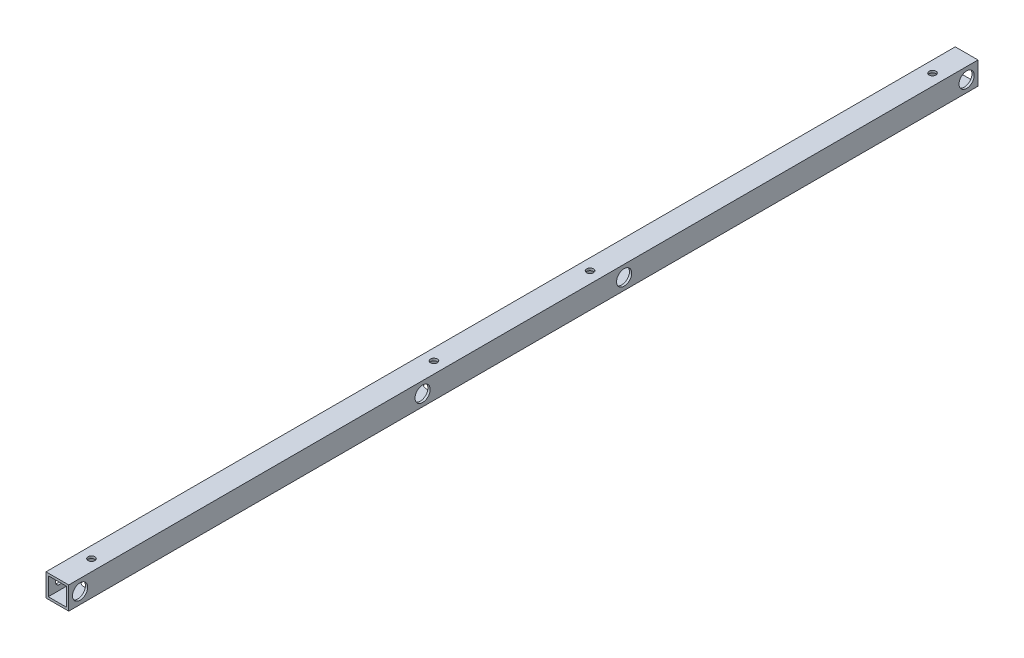
ISO-10303-21;
HEADER;
FILE_DESCRIPTION(('STEP AP214'),'2;1');
FILE_NAME('part.step','',(''),(''),'','','');
FILE_SCHEMA(('AUTOMOTIVE_DESIGN { 1 0 10303 214 1 1 1 1 }'));
ENDSEC;
DATA;
#1=APPLICATION_CONTEXT('core data for automotive mechanical design processes');
#2=APPLICATION_PROTOCOL_DEFINITION('international standard','automotive_design',2000,#1);
#3=PRODUCT_CONTEXT('',#1,'mechanical');
#4=PRODUCT('Part','Part','',(#3));
#5=PRODUCT_RELATED_PRODUCT_CATEGORY('part','',(#4));
#6=PRODUCT_DEFINITION_FORMATION('','',#4);
#7=PRODUCT_DEFINITION_CONTEXT('part definition',#1,'design');
#8=PRODUCT_DEFINITION('design','',#6,#7);
#9=PRODUCT_DEFINITION_SHAPE('','',#8);
#10=(LENGTH_UNIT() NAMED_UNIT(*) SI_UNIT(.MILLI.,.METRE.));
#11=(NAMED_UNIT(*) PLANE_ANGLE_UNIT() SI_UNIT($,.RADIAN.));
#12=(NAMED_UNIT(*) SI_UNIT($,.STERADIAN.) SOLID_ANGLE_UNIT());
#13=UNCERTAINTY_MEASURE_WITH_UNIT(LENGTH_MEASURE(1.E-05),#10,'distance_accuracy_value','');
#14=(GEOMETRIC_REPRESENTATION_CONTEXT(3) GLOBAL_UNCERTAINTY_ASSIGNED_CONTEXT((#13)) GLOBAL_UNIT_ASSIGNED_CONTEXT((#10,
#11,#12)) REPRESENTATION_CONTEXT('',''));
#15=CARTESIAN_POINT('',(0.,0.,0.));
#16=DIRECTION('',(0.,0.,1.));
#17=DIRECTION('',(1.,0.,0.));
#18=AXIS2_PLACEMENT_3D('',#15,#16,#17);
#19=CARTESIAN_POINT('',(0.,0.,600.));
#20=DIRECTION('',(0.,0.,-1.));
#21=DIRECTION('',(-1.,0.,0.));
#22=AXIS2_PLACEMENT_3D('',#19,#20,#21);
#23=PLANE('',#22);
#24=DIRECTION('',(0.,1.,0.));
#25=VECTOR('',#24,1.);
#26=CARTESIAN_POINT('',(7.5,-7.5,600.));
#27=LINE('',#26,#25);
#28=CARTESIAN_POINT('',(7.5,-7.5,600.));
#29=VERTEX_POINT('',#28);
#30=CARTESIAN_POINT('',(7.5,7.5,600.));
#31=VERTEX_POINT('',#30);
#32=EDGE_CURVE('E167',#29,#31,#27,.T.);
#33=ORIENTED_EDGE('',*,*,#32,.T.);
#34=DIRECTION('',(-1.,0.,0.));
#35=VECTOR('',#34,1.);
#36=CARTESIAN_POINT('',(-7.5,7.5,600.));
#37=LINE('',#36,#35);
#38=CARTESIAN_POINT('',(-7.5,7.5,600.));
#39=VERTEX_POINT('',#38);
#40=EDGE_CURVE('E171',#31,#39,#37,.T.);
#41=ORIENTED_EDGE('',*,*,#40,.T.);
#42=DIRECTION('',(0.,-1.,0.));
#43=VECTOR('',#42,1.);
#44=CARTESIAN_POINT('',(-7.5,-7.5,600.));
#45=LINE('',#44,#43);
#46=CARTESIAN_POINT('',(-7.5,-7.5,600.));
#47=VERTEX_POINT('',#46);
#48=EDGE_CURVE('E175',#39,#47,#45,.T.);
#49=ORIENTED_EDGE('',*,*,#48,.T.);
#50=DIRECTION('',(1.,0.,0.));
#51=VECTOR('',#50,1.);
#52=CARTESIAN_POINT('',(-7.5,-7.5,600.));
#53=LINE('',#52,#51);
#54=EDGE_CURVE('E178',#47,#29,#53,.T.);
#55=ORIENTED_EDGE('',*,*,#54,.T.);
#56=EDGE_LOOP('',(#33,#41,#49,#55));
#57=FACE_BOUND('',#56,.T.);
#58=DIRECTION('',(0.,1.,0.));
#59=VECTOR('',#58,1.);
#60=CARTESIAN_POINT('',(6.,-6.,600.));
#61=LINE('',#60,#59);
#62=CARTESIAN_POINT('',(6.,-6.,600.));
#63=VERTEX_POINT('',#62);
#64=CARTESIAN_POINT('',(6.,6.,600.));
#65=VERTEX_POINT('',#64);
#66=EDGE_CURVE('E115',#63,#65,#61,.T.);
#67=ORIENTED_EDGE('',*,*,#66,.F.);
#68=DIRECTION('',(1.,0.,0.));
#69=VECTOR('',#68,1.);
#70=CARTESIAN_POINT('',(-6.,-6.,600.));
#71=LINE('',#70,#69);
#72=CARTESIAN_POINT('',(-6.,-6.,600.));
#73=VERTEX_POINT('',#72);
#74=EDGE_CURVE('E143',#73,#63,#71,.T.);
#75=ORIENTED_EDGE('',*,*,#74,.F.);
#76=DIRECTION('',(0.,-1.,0.));
#77=VECTOR('',#76,1.);
#78=CARTESIAN_POINT('',(-6.,-6.,600.));
#79=LINE('',#78,#77);
#80=CARTESIAN_POINT('',(-6.,6.,600.));
#81=VERTEX_POINT('',#80);
#82=EDGE_CURVE('E137',#81,#73,#79,.T.);
#83=ORIENTED_EDGE('',*,*,#82,.F.);
#84=DIRECTION('',(-1.,0.,0.));
#85=VECTOR('',#84,1.);
#86=CARTESIAN_POINT('',(-6.,6.,600.));
#87=LINE('',#86,#85);
#88=EDGE_CURVE('E124',#65,#81,#87,.T.);
#89=ORIENTED_EDGE('',*,*,#88,.F.);
#90=EDGE_LOOP('',(#67,#75,#83,#89));
#91=FACE_BOUND('',#90,.T.);
#92=ADVANCED_FACE('F47',(#57,#91),#23,.F.);
#93=CARTESIAN_POINT('',(0.,0.,0.));
#94=DIRECTION('',(0.,0.,-1.));
#95=DIRECTION('',(-1.,0.,0.));
#96=AXIS2_PLACEMENT_3D('',#93,#94,#95);
#97=PLANE('',#96);
#98=DIRECTION('',(0.,1.,0.));
#99=VECTOR('',#98,1.);
#100=CARTESIAN_POINT('',(7.5,-7.5,0.));
#101=LINE('',#100,#99);
#102=CARTESIAN_POINT('',(7.5,-7.5,0.));
#103=VERTEX_POINT('',#102);
#104=CARTESIAN_POINT('',(7.5,7.5,0.));
#105=VERTEX_POINT('',#104);
#106=EDGE_CURVE('E133',#103,#105,#101,.T.);
#107=ORIENTED_EDGE('',*,*,#106,.F.);
#108=DIRECTION('',(1.,0.,0.));
#109=VECTOR('',#108,1.);
#110=CARTESIAN_POINT('',(-7.5,-7.5,0.));
#111=LINE('',#110,#109);
#112=CARTESIAN_POINT('',(-7.5,-7.5,0.));
#113=VERTEX_POINT('',#112);
#114=EDGE_CURVE('E172',#113,#103,#111,.T.);
#115=ORIENTED_EDGE('',*,*,#114,.F.);
#116=DIRECTION('',(0.,-1.,0.));
#117=VECTOR('',#116,1.);
#118=CARTESIAN_POINT('',(-7.5,-7.5,0.));
#119=LINE('',#118,#117);
#120=CARTESIAN_POINT('',(-7.5,7.5,0.));
#121=VERTEX_POINT('',#120);
#122=EDGE_CURVE('E188',#121,#113,#119,.T.);
#123=ORIENTED_EDGE('',*,*,#122,.F.);
#124=DIRECTION('',(-1.,0.,0.));
#125=VECTOR('',#124,1.);
#126=CARTESIAN_POINT('',(-7.5,7.5,0.));
#127=LINE('',#126,#125);
#128=EDGE_CURVE('E185',#105,#121,#127,.T.);
#129=ORIENTED_EDGE('',*,*,#128,.F.);
#130=EDGE_LOOP('',(#107,#115,#123,#129));
#131=FACE_BOUND('',#130,.T.);
#132=DIRECTION('',(1.,0.,0.));
#133=VECTOR('',#132,1.);
#134=CARTESIAN_POINT('',(-6.,-6.,0.));
#135=LINE('',#134,#133);
#136=CARTESIAN_POINT('',(-6.,-6.,0.));
#137=VERTEX_POINT('',#136);
#138=CARTESIAN_POINT('',(6.,-6.,0.));
#139=VERTEX_POINT('',#138);
#140=EDGE_CURVE('E125',#137,#139,#135,.T.);
#141=ORIENTED_EDGE('',*,*,#140,.T.);
#142=DIRECTION('',(0.,1.,0.));
#143=VECTOR('',#142,1.);
#144=CARTESIAN_POINT('',(6.,-6.,0.));
#145=LINE('',#144,#143);
#146=CARTESIAN_POINT('',(6.,6.,0.));
#147=VERTEX_POINT('',#146);
#148=EDGE_CURVE('E73',#139,#147,#145,.T.);
#149=ORIENTED_EDGE('',*,*,#148,.T.);
#150=DIRECTION('',(-1.,0.,0.));
#151=VECTOR('',#150,1.);
#152=CARTESIAN_POINT('',(-6.,6.,0.));
#153=LINE('',#152,#151);
#154=CARTESIAN_POINT('',(-6.,6.,0.));
#155=VERTEX_POINT('',#154);
#156=EDGE_CURVE('E131',#147,#155,#153,.T.);
#157=ORIENTED_EDGE('',*,*,#156,.T.);
#158=DIRECTION('',(0.,-1.,0.));
#159=VECTOR('',#158,1.);
#160=CARTESIAN_POINT('',(-6.,-6.,0.));
#161=LINE('',#160,#159);
#162=EDGE_CURVE('E154',#155,#137,#161,.T.);
#163=ORIENTED_EDGE('',*,*,#162,.T.);
#164=EDGE_LOOP('',(#141,#149,#157,#163));
#165=FACE_BOUND('',#164,.T.);
#166=ADVANCED_FACE('F340',(#131,#165),#97,.T.);
#167=CARTESIAN_POINT('',(7.5,-7.5,600.));
#168=DIRECTION('',(-1.,0.,0.));
#169=DIRECTION('',(0.,0.,1.));
#170=AXIS2_PLACEMENT_3D('',#167,#168,#169);
#171=PLANE('',#170);
#172=CARTESIAN_POINT('',(7.5,0.,592.5));
#173=DIRECTION('',(1.,0.,0.));
#174=DIRECTION('',(0.,0.,-1.));
#175=AXIS2_PLACEMENT_3D('',#172,#173,#174);
#176=CIRCLE('',#175,5.00000000000004);
#177=CARTESIAN_POINT('',(7.5,0.,587.5));
#178=VERTEX_POINT('',#177);
#179=EDGE_CURVE('E229',#178,#178,#176,.T.);
#180=ORIENTED_EDGE('',*,*,#179,.F.);
#181=EDGE_LOOP('',(#180));
#182=FACE_BOUND('',#181,.T.);
#183=CARTESIAN_POINT('',(7.5,0.,366.5));
#184=DIRECTION('',(1.,0.,0.));
#185=DIRECTION('',(0.,0.,-1.));
#186=AXIS2_PLACEMENT_3D('',#183,#184,#185);
#187=CIRCLE('',#186,4.99999999999999);
#188=CARTESIAN_POINT('',(7.5,0.,361.5));
#189=VERTEX_POINT('',#188);
#190=EDGE_CURVE('E272',#189,#189,#187,.T.);
#191=ORIENTED_EDGE('',*,*,#190,.F.);
#192=EDGE_LOOP('',(#191));
#193=FACE_BOUND('',#192,.T.);
#194=CARTESIAN_POINT('',(7.5,0.,233.5));
#195=DIRECTION('',(1.,0.,0.));
#196=DIRECTION('',(0.,0.,-1.));
#197=AXIS2_PLACEMENT_3D('',#194,#195,#196);
#198=CIRCLE('',#197,4.99999999999999);
#199=CARTESIAN_POINT('',(7.5,0.,228.5));
#200=VERTEX_POINT('',#199);
#201=EDGE_CURVE('E264',#200,#200,#198,.T.);
#202=ORIENTED_EDGE('',*,*,#201,.F.);
#203=EDGE_LOOP('',(#202));
#204=FACE_BOUND('',#203,.T.);
#205=CARTESIAN_POINT('',(7.5,0.,7.5));
#206=DIRECTION('',(1.,0.,0.));
#207=DIRECTION('',(0.,0.,-1.));
#208=AXIS2_PLACEMENT_3D('',#205,#206,#207);
#209=CIRCLE('',#208,5.);
#210=CARTESIAN_POINT('',(7.5,0.,2.5));
#211=VERTEX_POINT('',#210);
#212=EDGE_CURVE('E257',#211,#211,#209,.T.);
#213=ORIENTED_EDGE('',*,*,#212,.F.);
#214=EDGE_LOOP('',(#213));
#215=FACE_BOUND('',#214,.T.);
#216=ORIENTED_EDGE('',*,*,#106,.T.);
#217=DIRECTION('',(0.,0.,-1.));
#218=VECTOR('',#217,1.);
#219=CARTESIAN_POINT('',(7.5,7.5,600.));
#220=LINE('',#219,#218);
#221=EDGE_CURVE('E11',#31,#105,#220,.T.);
#222=ORIENTED_EDGE('',*,*,#221,.F.);
#223=ORIENTED_EDGE('',*,*,#32,.F.);
#224=DIRECTION('',(0.,0.,-1.));
#225=VECTOR('',#224,1.);
#226=CARTESIAN_POINT('',(7.5,-7.5,600.));
#227=LINE('',#226,#225);
#228=EDGE_CURVE('E181',#29,#103,#227,.T.);
#229=ORIENTED_EDGE('',*,*,#228,.T.);
#230=EDGE_LOOP('',(#216,#222,#223,#229));
#231=FACE_BOUND('',#230,.T.);
#232=ADVANCED_FACE('F49',(#182,#193,#204,#215,#231),#171,.F.);
#233=CARTESIAN_POINT('',(-7.5,7.5,600.));
#234=DIRECTION('',(0.,-1.,0.));
#235=DIRECTION('',(0.,0.,-1.));
#236=AXIS2_PLACEMENT_3D('',#233,#234,#235);
#237=PLANE('',#236);
#238=CARTESIAN_POINT('',(0.,7.5,577.5));
#239=DIRECTION('',(0.,1.,0.));
#240=DIRECTION('',(0.,0.,1.));
#241=AXIS2_PLACEMENT_3D('',#238,#239,#240);
#242=CIRCLE('',#241,2.24999999999998);
#243=CARTESIAN_POINT('',(0.,7.5,579.75));
#244=VERTEX_POINT('',#243);
#245=EDGE_CURVE('E282',#244,#244,#242,.T.);
#246=ORIENTED_EDGE('',*,*,#245,.F.);
#247=EDGE_LOOP('',(#246));
#248=FACE_BOUND('',#247,.T.);
#249=CARTESIAN_POINT('',(0.,7.5,22.5));
#250=DIRECTION('',(0.,1.,0.));
#251=DIRECTION('',(0.,0.,1.));
#252=AXIS2_PLACEMENT_3D('',#249,#250,#251);
#253=CIRCLE('',#252,2.25);
#254=CARTESIAN_POINT('',(0.,7.5,24.75));
#255=VERTEX_POINT('',#254);
#256=EDGE_CURVE('E288',#255,#255,#253,.T.);
#257=ORIENTED_EDGE('',*,*,#256,.F.);
#258=EDGE_LOOP('',(#257));
#259=FACE_BOUND('',#258,.T.);
#260=CARTESIAN_POINT('',(0.,7.5,351.5));
#261=DIRECTION('',(0.,1.,0.));
#262=DIRECTION('',(0.,0.,1.));
#263=AXIS2_PLACEMENT_3D('',#260,#261,#262);
#264=CIRCLE('',#263,2.25);
#265=CARTESIAN_POINT('',(0.,7.5,353.75));
#266=VERTEX_POINT('',#265);
#267=EDGE_CURVE('E283',#266,#266,#264,.T.);
#268=ORIENTED_EDGE('',*,*,#267,.F.);
#269=EDGE_LOOP('',(#268));
#270=FACE_BOUND('',#269,.T.);
#271=CARTESIAN_POINT('',(0.,7.5,248.5));
#272=DIRECTION('',(0.,1.,0.));
#273=DIRECTION('',(0.,0.,1.));
#274=AXIS2_PLACEMENT_3D('',#271,#272,#273);
#275=CIRCLE('',#274,2.25);
#276=CARTESIAN_POINT('',(0.,7.5,250.75));
#277=VERTEX_POINT('',#276);
#278=EDGE_CURVE('E287',#277,#277,#275,.T.);
#279=ORIENTED_EDGE('',*,*,#278,.F.);
#280=EDGE_LOOP('',(#279));
#281=FACE_BOUND('',#280,.T.);
#282=ORIENTED_EDGE('',*,*,#128,.T.);
#283=DIRECTION('',(0.,0.,-1.));
#284=VECTOR('',#283,1.);
#285=CARTESIAN_POINT('',(-7.5,7.5,600.));
#286=LINE('',#285,#284);
#287=EDGE_CURVE('E57',#39,#121,#286,.T.);
#288=ORIENTED_EDGE('',*,*,#287,.F.);
#289=ORIENTED_EDGE('',*,*,#40,.F.);
#290=ORIENTED_EDGE('',*,*,#221,.T.);
#291=EDGE_LOOP('',(#282,#288,#289,#290));
#292=FACE_BOUND('',#291,.T.);
#293=ADVANCED_FACE('F355',(#248,#259,#270,#281,#292),#237,.F.);
#294=CARTESIAN_POINT('',(-7.5,-7.5,600.));
#295=DIRECTION('',(1.,0.,0.));
#296=DIRECTION('',(0.,0.,-1.));
#297=AXIS2_PLACEMENT_3D('',#294,#295,#296);
#298=PLANE('',#297);
#299=CARTESIAN_POINT('',(-7.5,0.,366.5));
#300=DIRECTION('',(1.,0.,0.));
#301=DIRECTION('',(0.,0.,-1.));
#302=AXIS2_PLACEMENT_3D('',#299,#300,#301);
#303=CIRCLE('',#302,2.69999999999996);
#304=CARTESIAN_POINT('',(-7.5,0.,363.8));
#305=VERTEX_POINT('',#304);
#306=EDGE_CURVE('E223',#305,#305,#303,.T.);
#307=ORIENTED_EDGE('',*,*,#306,.T.);
#308=EDGE_LOOP('',(#307));
#309=FACE_BOUND('',#308,.T.);
#310=CARTESIAN_POINT('',(-7.5,0.,233.5));
#311=DIRECTION('',(1.,0.,0.));
#312=DIRECTION('',(0.,0.,-1.));
#313=AXIS2_PLACEMENT_3D('',#310,#311,#312);
#314=CIRCLE('',#313,2.70000000000001);
#315=CARTESIAN_POINT('',(-7.5,0.,230.8));
#316=VERTEX_POINT('',#315);
#317=EDGE_CURVE('E217',#316,#316,#314,.T.);
#318=ORIENTED_EDGE('',*,*,#317,.T.);
#319=EDGE_LOOP('',(#318));
#320=FACE_BOUND('',#319,.T.);
#321=CARTESIAN_POINT('',(-7.5,0.,592.5));
#322=DIRECTION('',(1.,0.,0.));
#323=DIRECTION('',(0.,0.,-1.));
#324=AXIS2_PLACEMENT_3D('',#321,#322,#323);
#325=CIRCLE('',#324,2.70000000000001);
#326=CARTESIAN_POINT('',(-7.5,0.,589.8));
#327=VERTEX_POINT('',#326);
#328=EDGE_CURVE('E151',#327,#327,#325,.T.);
#329=ORIENTED_EDGE('',*,*,#328,.T.);
#330=EDGE_LOOP('',(#329));
#331=FACE_BOUND('',#330,.T.);
#332=CARTESIAN_POINT('',(-7.5,0.,7.5));
#333=DIRECTION('',(1.,0.,0.));
#334=DIRECTION('',(0.,0.,-1.));
#335=AXIS2_PLACEMENT_3D('',#332,#333,#334);
#336=CIRCLE('',#335,2.7);
#337=CARTESIAN_POINT('',(-7.5,0.,4.8));
#338=VERTEX_POINT('',#337);
#339=EDGE_CURVE('E207',#338,#338,#336,.T.);
#340=ORIENTED_EDGE('',*,*,#339,.T.);
#341=EDGE_LOOP('',(#340));
#342=FACE_BOUND('',#341,.T.);
#343=ORIENTED_EDGE('',*,*,#122,.T.);
#344=DIRECTION('',(0.,0.,-1.));
#345=VECTOR('',#344,1.);
#346=CARTESIAN_POINT('',(-7.5,-7.5,600.));
#347=LINE('',#346,#345);
#348=EDGE_CURVE('E196',#47,#113,#347,.T.);
#349=ORIENTED_EDGE('',*,*,#348,.F.);
#350=ORIENTED_EDGE('',*,*,#48,.F.);
#351=ORIENTED_EDGE('',*,*,#287,.T.);
#352=EDGE_LOOP('',(#343,#349,#350,#351));
#353=FACE_BOUND('',#352,.T.);
#354=ADVANCED_FACE('F321',(#309,#320,#331,#342,#353),#298,.F.);
#355=CARTESIAN_POINT('',(-7.5,-7.5,600.));
#356=DIRECTION('',(0.,1.,0.));
#357=DIRECTION('',(0.,0.,1.));
#358=AXIS2_PLACEMENT_3D('',#355,#356,#357);
#359=PLANE('',#358);
#360=CARTESIAN_POINT('',(0.,-7.5,577.5));
#361=DIRECTION('',(0.,-1.,0.));
#362=DIRECTION('',(0.,0.,-1.));
#363=AXIS2_PLACEMENT_3D('',#360,#361,#362);
#364=CIRCLE('',#363,5.);
#365=CARTESIAN_POINT('',(0.,-7.5,572.5));
#366=VERTEX_POINT('',#365);
#367=EDGE_CURVE('E245',#366,#366,#364,.T.);
#368=ORIENTED_EDGE('',*,*,#367,.F.);
#369=EDGE_LOOP('',(#368));
#370=FACE_BOUND('',#369,.T.);
#371=CARTESIAN_POINT('',(0.,-7.5,22.5));
#372=DIRECTION('',(0.,-1.,0.));
#373=DIRECTION('',(0.,0.,-1.));
#374=AXIS2_PLACEMENT_3D('',#371,#372,#373);
#375=CIRCLE('',#374,5.);
#376=CARTESIAN_POINT('',(0.,-7.5,17.5));
#377=VERTEX_POINT('',#376);
#378=EDGE_CURVE('E480',#377,#377,#375,.T.);
#379=ORIENTED_EDGE('',*,*,#378,.F.);
#380=EDGE_LOOP('',(#379));
#381=FACE_BOUND('',#380,.T.);
#382=CARTESIAN_POINT('',(0.,-7.5,248.5));
#383=DIRECTION('',(0.,-1.,0.));
#384=DIRECTION('',(0.,0.,-1.));
#385=AXIS2_PLACEMENT_3D('',#382,#383,#384);
#386=CIRCLE('',#385,5.);
#387=CARTESIAN_POINT('',(0.,-7.5,243.5));
#388=VERTEX_POINT('',#387);
#389=EDGE_CURVE('E486',#388,#388,#386,.T.);
#390=ORIENTED_EDGE('',*,*,#389,.F.);
#391=EDGE_LOOP('',(#390));
#392=FACE_BOUND('',#391,.T.);
#393=CARTESIAN_POINT('',(0.,-7.5,351.5));
#394=DIRECTION('',(0.,-1.,0.));
#395=DIRECTION('',(0.,0.,-1.));
#396=AXIS2_PLACEMENT_3D('',#393,#394,#395);
#397=CIRCLE('',#396,5.);
#398=CARTESIAN_POINT('',(0.,-7.5,346.5));
#399=VERTEX_POINT('',#398);
#400=EDGE_CURVE('E492',#399,#399,#397,.T.);
#401=ORIENTED_EDGE('',*,*,#400,.F.);
#402=EDGE_LOOP('',(#401));
#403=FACE_BOUND('',#402,.T.);
#404=ORIENTED_EDGE('',*,*,#114,.T.);
#405=ORIENTED_EDGE('',*,*,#228,.F.);
#406=ORIENTED_EDGE('',*,*,#54,.F.);
#407=ORIENTED_EDGE('',*,*,#348,.T.);
#408=EDGE_LOOP('',(#404,#405,#406,#407));
#409=FACE_BOUND('',#408,.T.);
#410=ADVANCED_FACE('F350',(#370,#381,#392,#403,#409),#359,.F.);
#411=CARTESIAN_POINT('',(6.,-6.,600.));
#412=DIRECTION('',(-1.,0.,0.));
#413=DIRECTION('',(0.,0.,1.));
#414=AXIS2_PLACEMENT_3D('',#411,#412,#413);
#415=PLANE('',#414);
#416=CARTESIAN_POINT('',(6.,0.,592.5));
#417=DIRECTION('',(-1.,0.,0.));
#418=DIRECTION('',(0.,0.,1.));
#419=AXIS2_PLACEMENT_3D('',#416,#417,#418);
#420=CIRCLE('',#419,5.00000000000004);
#421=CARTESIAN_POINT('',(6.,0.,597.5));
#422=VERTEX_POINT('',#421);
#423=EDGE_CURVE('E218',#422,#422,#420,.T.);
#424=ORIENTED_EDGE('',*,*,#423,.F.);
#425=EDGE_LOOP('',(#424));
#426=FACE_BOUND('',#425,.T.);
#427=CARTESIAN_POINT('',(6.,0.,366.5));
#428=DIRECTION('',(-1.,0.,0.));
#429=DIRECTION('',(0.,0.,1.));
#430=AXIS2_PLACEMENT_3D('',#427,#428,#429);
#431=CIRCLE('',#430,4.99999999999999);
#432=CARTESIAN_POINT('',(6.,0.,371.5));
#433=VERTEX_POINT('',#432);
#434=EDGE_CURVE('E233',#433,#433,#431,.T.);
#435=ORIENTED_EDGE('',*,*,#434,.F.);
#436=EDGE_LOOP('',(#435));
#437=FACE_BOUND('',#436,.T.);
#438=CARTESIAN_POINT('',(6.,0.,233.5));
#439=DIRECTION('',(-1.,0.,0.));
#440=DIRECTION('',(0.,0.,1.));
#441=AXIS2_PLACEMENT_3D('',#438,#439,#440);
#442=CIRCLE('',#441,4.99999999999999);
#443=CARTESIAN_POINT('',(6.,0.,238.5));
#444=VERTEX_POINT('',#443);
#445=EDGE_CURVE('E228',#444,#444,#442,.T.);
#446=ORIENTED_EDGE('',*,*,#445,.F.);
#447=EDGE_LOOP('',(#446));
#448=FACE_BOUND('',#447,.T.);
#449=CARTESIAN_POINT('',(6.,0.,7.5));
#450=DIRECTION('',(-1.,0.,0.));
#451=DIRECTION('',(0.,0.,1.));
#452=AXIS2_PLACEMENT_3D('',#449,#450,#451);
#453=CIRCLE('',#452,5.);
#454=CARTESIAN_POINT('',(6.,0.,12.5));
#455=VERTEX_POINT('',#454);
#456=EDGE_CURVE('E224',#455,#455,#453,.T.);
#457=ORIENTED_EDGE('',*,*,#456,.F.);
#458=EDGE_LOOP('',(#457));
#459=FACE_BOUND('',#458,.T.);
#460=ORIENTED_EDGE('',*,*,#148,.F.);
#461=DIRECTION('',(0.,0.,-1.));
#462=VECTOR('',#461,1.);
#463=CARTESIAN_POINT('',(6.,-6.,600.));
#464=LINE('',#463,#462);
#465=EDGE_CURVE('E119',#63,#139,#464,.T.);
#466=ORIENTED_EDGE('',*,*,#465,.F.);
#467=ORIENTED_EDGE('',*,*,#66,.T.);
#468=DIRECTION('',(0.,0.,-1.));
#469=VECTOR('',#468,1.);
#470=CARTESIAN_POINT('',(6.,6.,600.));
#471=LINE('',#470,#469);
#472=EDGE_CURVE('E118',#65,#147,#471,.T.);
#473=ORIENTED_EDGE('',*,*,#472,.T.);
#474=EDGE_LOOP('',(#460,#466,#467,#473));
#475=FACE_BOUND('',#474,.T.);
#476=ADVANCED_FACE('F117',(#426,#437,#448,#459,#475),#415,.T.);
#477=CARTESIAN_POINT('',(-6.,6.,600.));
#478=DIRECTION('',(0.,-1.,0.));
#479=DIRECTION('',(0.,0.,-1.));
#480=AXIS2_PLACEMENT_3D('',#477,#478,#479);
#481=PLANE('',#480);
#482=CARTESIAN_POINT('',(0.,6.,577.5));
#483=DIRECTION('',(0.,-1.,0.));
#484=DIRECTION('',(0.,0.,-1.));
#485=AXIS2_PLACEMENT_3D('',#482,#483,#484);
#486=CIRCLE('',#485,2.24999999999998);
#487=CARTESIAN_POINT('',(0.,6.,575.25));
#488=VERTEX_POINT('',#487);
#489=EDGE_CURVE('E208',#488,#488,#486,.T.);
#490=ORIENTED_EDGE('',*,*,#489,.F.);
#491=EDGE_LOOP('',(#490));
#492=FACE_BOUND('',#491,.T.);
#493=CARTESIAN_POINT('',(0.,6.,22.5));
#494=DIRECTION('',(0.,-1.,0.));
#495=DIRECTION('',(0.,0.,-1.));
#496=AXIS2_PLACEMENT_3D('',#493,#494,#495);
#497=CIRCLE('',#496,2.25);
#498=CARTESIAN_POINT('',(0.,6.,20.25));
#499=VERTEX_POINT('',#498);
#500=EDGE_CURVE('E306',#499,#499,#497,.T.);
#501=ORIENTED_EDGE('',*,*,#500,.F.);
#502=EDGE_LOOP('',(#501));
#503=FACE_BOUND('',#502,.T.);
#504=CARTESIAN_POINT('',(0.,6.,351.5));
#505=DIRECTION('',(0.,-1.,0.));
#506=DIRECTION('',(0.,0.,-1.));
#507=AXIS2_PLACEMENT_3D('',#504,#505,#506);
#508=CIRCLE('',#507,2.25);
#509=CARTESIAN_POINT('',(0.,6.,349.25));
#510=VERTEX_POINT('',#509);
#511=EDGE_CURVE('E302',#510,#510,#508,.T.);
#512=ORIENTED_EDGE('',*,*,#511,.F.);
#513=EDGE_LOOP('',(#512));
#514=FACE_BOUND('',#513,.T.);
#515=CARTESIAN_POINT('',(0.,6.,248.5));
#516=DIRECTION('',(0.,-1.,0.));
#517=DIRECTION('',(0.,0.,-1.));
#518=AXIS2_PLACEMENT_3D('',#515,#516,#517);
#519=CIRCLE('',#518,2.25);
#520=CARTESIAN_POINT('',(0.,6.,246.25));
#521=VERTEX_POINT('',#520);
#522=EDGE_CURVE('E298',#521,#521,#519,.T.);
#523=ORIENTED_EDGE('',*,*,#522,.F.);
#524=EDGE_LOOP('',(#523));
#525=FACE_BOUND('',#524,.T.);
#526=ORIENTED_EDGE('',*,*,#156,.F.);
#527=ORIENTED_EDGE('',*,*,#472,.F.);
#528=ORIENTED_EDGE('',*,*,#88,.T.);
#529=DIRECTION('',(0.,0.,-1.));
#530=VECTOR('',#529,1.);
#531=CARTESIAN_POINT('',(-6.,6.,600.));
#532=LINE('',#531,#530);
#533=EDGE_CURVE('E134',#81,#155,#532,.T.);
#534=ORIENTED_EDGE('',*,*,#533,.T.);
#535=EDGE_LOOP('',(#526,#527,#528,#534));
#536=FACE_BOUND('',#535,.T.);
#537=ADVANCED_FACE('F128',(#492,#503,#514,#525,#536),#481,.T.);
#538=CARTESIAN_POINT('',(-6.,-6.,600.));
#539=DIRECTION('',(1.,0.,0.));
#540=DIRECTION('',(0.,0.,-1.));
#541=AXIS2_PLACEMENT_3D('',#538,#539,#540);
#542=PLANE('',#541);
#543=CARTESIAN_POINT('',(-6.,0.,366.5));
#544=DIRECTION('',(1.,0.,0.));
#545=DIRECTION('',(0.,0.,-1.));
#546=AXIS2_PLACEMENT_3D('',#543,#544,#545);
#547=CIRCLE('',#546,2.69999999999996);
#548=CARTESIAN_POINT('',(-6.,0.,363.8));
#549=VERTEX_POINT('',#548);
#550=EDGE_CURVE('E219',#549,#549,#547,.T.);
#551=ORIENTED_EDGE('',*,*,#550,.F.);
#552=EDGE_LOOP('',(#551));
#553=FACE_BOUND('',#552,.T.);
#554=CARTESIAN_POINT('',(-6.,0.,233.5));
#555=DIRECTION('',(1.,0.,0.));
#556=DIRECTION('',(0.,0.,-1.));
#557=AXIS2_PLACEMENT_3D('',#554,#555,#556);
#558=CIRCLE('',#557,2.70000000000001);
#559=CARTESIAN_POINT('',(-6.,0.,230.8));
#560=VERTEX_POINT('',#559);
#561=EDGE_CURVE('E213',#560,#560,#558,.T.);
#562=ORIENTED_EDGE('',*,*,#561,.F.);
#563=EDGE_LOOP('',(#562));
#564=FACE_BOUND('',#563,.T.);
#565=CARTESIAN_POINT('',(-6.,0.,592.5));
#566=DIRECTION('',(1.,0.,0.));
#567=DIRECTION('',(0.,0.,-1.));
#568=AXIS2_PLACEMENT_3D('',#565,#566,#567);
#569=CIRCLE('',#568,2.70000000000001);
#570=CARTESIAN_POINT('',(-6.,0.,589.8));
#571=VERTEX_POINT('',#570);
#572=EDGE_CURVE('E209',#571,#571,#569,.T.);
#573=ORIENTED_EDGE('',*,*,#572,.F.);
#574=EDGE_LOOP('',(#573));
#575=FACE_BOUND('',#574,.T.);
#576=CARTESIAN_POINT('',(-6.,0.,7.5));
#577=DIRECTION('',(1.,0.,0.));
#578=DIRECTION('',(0.,0.,-1.));
#579=AXIS2_PLACEMENT_3D('',#576,#577,#578);
#580=CIRCLE('',#579,2.7);
#581=CARTESIAN_POINT('',(-6.,0.,4.8));
#582=VERTEX_POINT('',#581);
#583=EDGE_CURVE('E203',#582,#582,#580,.T.);
#584=ORIENTED_EDGE('',*,*,#583,.F.);
#585=EDGE_LOOP('',(#584));
#586=FACE_BOUND('',#585,.T.);
#587=ORIENTED_EDGE('',*,*,#162,.F.);
#588=ORIENTED_EDGE('',*,*,#533,.F.);
#589=ORIENTED_EDGE('',*,*,#82,.T.);
#590=DIRECTION('',(0.,0.,-1.));
#591=VECTOR('',#590,1.);
#592=CARTESIAN_POINT('',(-6.,-6.,600.));
#593=LINE('',#592,#591);
#594=EDGE_CURVE('E65',#73,#137,#593,.T.);
#595=ORIENTED_EDGE('',*,*,#594,.T.);
#596=EDGE_LOOP('',(#587,#588,#589,#595));
#597=FACE_BOUND('',#596,.T.);
#598=ADVANCED_FACE('F386',(#553,#564,#575,#586,#597),#542,.T.);
#599=CARTESIAN_POINT('',(-6.,-6.,600.));
#600=DIRECTION('',(0.,1.,0.));
#601=DIRECTION('',(0.,0.,1.));
#602=AXIS2_PLACEMENT_3D('',#599,#600,#601);
#603=PLANE('',#602);
#604=CARTESIAN_POINT('',(0.,-6.,577.5));
#605=DIRECTION('',(0.,1.,0.));
#606=DIRECTION('',(0.,0.,1.));
#607=AXIS2_PLACEMENT_3D('',#604,#605,#606);
#608=CIRCLE('',#607,5.);
#609=CARTESIAN_POINT('',(0.,-6.,582.5));
#610=VERTEX_POINT('',#609);
#611=EDGE_CURVE('E51',#610,#610,#608,.T.);
#612=ORIENTED_EDGE('',*,*,#611,.F.);
#613=EDGE_LOOP('',(#612));
#614=FACE_BOUND('',#613,.T.);
#615=CARTESIAN_POINT('',(0.,-6.,22.5));
#616=DIRECTION('',(0.,1.,0.));
#617=DIRECTION('',(0.,0.,1.));
#618=AXIS2_PLACEMENT_3D('',#615,#616,#617);
#619=CIRCLE('',#618,5.);
#620=CARTESIAN_POINT('',(0.,-6.,27.5));
#621=VERTEX_POINT('',#620);
#622=EDGE_CURVE('E248',#621,#621,#619,.T.);
#623=ORIENTED_EDGE('',*,*,#622,.F.);
#624=EDGE_LOOP('',(#623));
#625=FACE_BOUND('',#624,.T.);
#626=CARTESIAN_POINT('',(0.,-6.,248.5));
#627=DIRECTION('',(0.,1.,0.));
#628=DIRECTION('',(0.,0.,1.));
#629=AXIS2_PLACEMENT_3D('',#626,#627,#628);
#630=CIRCLE('',#629,5.);
#631=CARTESIAN_POINT('',(0.,-6.,253.5));
#632=VERTEX_POINT('',#631);
#633=EDGE_CURVE('E244',#632,#632,#630,.T.);
#634=ORIENTED_EDGE('',*,*,#633,.F.);
#635=EDGE_LOOP('',(#634));
#636=FACE_BOUND('',#635,.T.);
#637=CARTESIAN_POINT('',(0.,-6.,351.5));
#638=DIRECTION('',(0.,1.,0.));
#639=DIRECTION('',(0.,0.,1.));
#640=AXIS2_PLACEMENT_3D('',#637,#638,#639);
#641=CIRCLE('',#640,5.);
#642=CARTESIAN_POINT('',(0.,-6.,356.5));
#643=VERTEX_POINT('',#642);
#644=EDGE_CURVE('E240',#643,#643,#641,.T.);
#645=ORIENTED_EDGE('',*,*,#644,.F.);
#646=EDGE_LOOP('',(#645));
#647=FACE_BOUND('',#646,.T.);
#648=ORIENTED_EDGE('',*,*,#140,.F.);
#649=ORIENTED_EDGE('',*,*,#594,.F.);
#650=ORIENTED_EDGE('',*,*,#74,.T.);
#651=ORIENTED_EDGE('',*,*,#465,.T.);
#652=EDGE_LOOP('',(#648,#649,#650,#651));
#653=FACE_BOUND('',#652,.T.);
#654=ADVANCED_FACE('F336',(#614,#625,#636,#647,#653),#603,.T.);
#655=CARTESIAN_POINT('',(-17.5,0.,7.5));
#656=DIRECTION('',(1.,0.,0.));
#657=DIRECTION('',(0.,0.,-1.));
#658=AXIS2_PLACEMENT_3D('',#655,#656,#657);
#659=CYLINDRICAL_SURFACE('',#658,2.7);
#660=ORIENTED_EDGE('',*,*,#583,.T.);
#661=EDGE_LOOP('',(#660));
#662=FACE_BOUND('',#661,.T.);
#663=ORIENTED_EDGE('',*,*,#339,.F.);
#664=EDGE_LOOP('',(#663));
#665=FACE_BOUND('',#664,.T.);
#666=ADVANCED_FACE('F327',(#662,#665),#659,.F.);
#667=CARTESIAN_POINT('',(-17.5,0.,592.5));
#668=DIRECTION('',(1.,0.,0.));
#669=DIRECTION('',(0.,0.,-1.));
#670=AXIS2_PLACEMENT_3D('',#667,#668,#669);
#671=CYLINDRICAL_SURFACE('',#670,2.70000000000001);
#672=ORIENTED_EDGE('',*,*,#572,.T.);
#673=EDGE_LOOP('',(#672));
#674=FACE_BOUND('',#673,.T.);
#675=ORIENTED_EDGE('',*,*,#328,.F.);
#676=EDGE_LOOP('',(#675));
#677=FACE_BOUND('',#676,.T.);
#678=ADVANCED_FACE('F324',(#674,#677),#671,.F.);
#679=CARTESIAN_POINT('',(0.,-17.5,248.5));
#680=DIRECTION('',(0.,1.,0.));
#681=DIRECTION('',(0.,0.,1.));
#682=AXIS2_PLACEMENT_3D('',#679,#680,#681);
#683=CYLINDRICAL_SURFACE('',#682,2.25);
#684=ORIENTED_EDGE('',*,*,#522,.T.);
#685=EDGE_LOOP('',(#684));
#686=FACE_BOUND('',#685,.T.);
#687=ORIENTED_EDGE('',*,*,#278,.T.);
#688=EDGE_LOOP('',(#687));
#689=FACE_BOUND('',#688,.T.);
#690=ADVANCED_FACE('F326',(#686,#689),#683,.F.);
#691=CARTESIAN_POINT('',(0.,-17.5,351.5));
#692=DIRECTION('',(0.,1.,0.));
#693=DIRECTION('',(0.,0.,1.));
#694=AXIS2_PLACEMENT_3D('',#691,#692,#693);
#695=CYLINDRICAL_SURFACE('',#694,2.25);
#696=ORIENTED_EDGE('',*,*,#511,.T.);
#697=EDGE_LOOP('',(#696));
#698=FACE_BOUND('',#697,.T.);
#699=ORIENTED_EDGE('',*,*,#267,.T.);
#700=EDGE_LOOP('',(#699));
#701=FACE_BOUND('',#700,.T.);
#702=ADVANCED_FACE('F333',(#698,#701),#695,.F.);
#703=CARTESIAN_POINT('',(0.,-17.5,22.5));
#704=DIRECTION('',(0.,1.,0.));
#705=DIRECTION('',(0.,0.,1.));
#706=AXIS2_PLACEMENT_3D('',#703,#704,#705);
#707=CYLINDRICAL_SURFACE('',#706,2.25);
#708=ORIENTED_EDGE('',*,*,#500,.T.);
#709=EDGE_LOOP('',(#708));
#710=FACE_BOUND('',#709,.T.);
#711=ORIENTED_EDGE('',*,*,#256,.T.);
#712=EDGE_LOOP('',(#711));
#713=FACE_BOUND('',#712,.T.);
#714=ADVANCED_FACE('F410',(#710,#713),#707,.F.);
#715=CARTESIAN_POINT('',(0.,-17.5,577.5));
#716=DIRECTION('',(0.,1.,0.));
#717=DIRECTION('',(0.,0.,1.));
#718=AXIS2_PLACEMENT_3D('',#715,#716,#717);
#719=CYLINDRICAL_SURFACE('',#718,2.24999999999998);
#720=ORIENTED_EDGE('',*,*,#489,.T.);
#721=EDGE_LOOP('',(#720));
#722=FACE_BOUND('',#721,.T.);
#723=ORIENTED_EDGE('',*,*,#245,.T.);
#724=EDGE_LOOP('',(#723));
#725=FACE_BOUND('',#724,.T.);
#726=ADVANCED_FACE('F414',(#722,#725),#719,.F.);
#727=CARTESIAN_POINT('',(-12.5,0.,233.5));
#728=DIRECTION('',(1.,0.,0.));
#729=DIRECTION('',(0.,0.,-1.));
#730=AXIS2_PLACEMENT_3D('',#727,#728,#729);
#731=CYLINDRICAL_SURFACE('',#730,2.70000000000001);
#732=ORIENTED_EDGE('',*,*,#561,.T.);
#733=EDGE_LOOP('',(#732));
#734=FACE_BOUND('',#733,.T.);
#735=ORIENTED_EDGE('',*,*,#317,.F.);
#736=EDGE_LOOP('',(#735));
#737=FACE_BOUND('',#736,.T.);
#738=ADVANCED_FACE('F418',(#734,#737),#731,.F.);
#739=CARTESIAN_POINT('',(-12.5,0.,366.5));
#740=DIRECTION('',(1.,0.,0.));
#741=DIRECTION('',(0.,0.,-1.));
#742=AXIS2_PLACEMENT_3D('',#739,#740,#741);
#743=CYLINDRICAL_SURFACE('',#742,2.69999999999996);
#744=ORIENTED_EDGE('',*,*,#550,.T.);
#745=EDGE_LOOP('',(#744));
#746=FACE_BOUND('',#745,.T.);
#747=ORIENTED_EDGE('',*,*,#306,.F.);
#748=EDGE_LOOP('',(#747));
#749=FACE_BOUND('',#748,.T.);
#750=ADVANCED_FACE('F425',(#746,#749),#743,.F.);
#751=CARTESIAN_POINT('',(-2.5,0.,7.5));
#752=DIRECTION('',(1.,0.,0.));
#753=DIRECTION('',(0.,0.,-1.));
#754=AXIS2_PLACEMENT_3D('',#751,#752,#753);
#755=CYLINDRICAL_SURFACE('',#754,5.);
#756=ORIENTED_EDGE('',*,*,#456,.T.);
#757=EDGE_LOOP('',(#756));
#758=FACE_BOUND('',#757,.T.);
#759=ORIENTED_EDGE('',*,*,#212,.T.);
#760=EDGE_LOOP('',(#759));
#761=FACE_BOUND('',#760,.T.);
#762=ADVANCED_FACE('F430',(#758,#761),#755,.F.);
#763=CARTESIAN_POINT('',(-2.5,0.,233.5));
#764=DIRECTION('',(1.,0.,0.));
#765=DIRECTION('',(0.,0.,-1.));
#766=AXIS2_PLACEMENT_3D('',#763,#764,#765);
#767=CYLINDRICAL_SURFACE('',#766,4.99999999999999);
#768=ORIENTED_EDGE('',*,*,#445,.T.);
#769=EDGE_LOOP('',(#768));
#770=FACE_BOUND('',#769,.T.);
#771=ORIENTED_EDGE('',*,*,#201,.T.);
#772=EDGE_LOOP('',(#771));
#773=FACE_BOUND('',#772,.T.);
#774=ADVANCED_FACE('F446',(#770,#773),#767,.F.);
#775=CARTESIAN_POINT('',(-2.5,0.,366.5));
#776=DIRECTION('',(1.,0.,0.));
#777=DIRECTION('',(0.,0.,-1.));
#778=AXIS2_PLACEMENT_3D('',#775,#776,#777);
#779=CYLINDRICAL_SURFACE('',#778,4.99999999999999);
#780=ORIENTED_EDGE('',*,*,#434,.T.);
#781=EDGE_LOOP('',(#780));
#782=FACE_BOUND('',#781,.T.);
#783=ORIENTED_EDGE('',*,*,#190,.T.);
#784=EDGE_LOOP('',(#783));
#785=FACE_BOUND('',#784,.T.);
#786=ADVANCED_FACE('F453',(#782,#785),#779,.F.);
#787=CARTESIAN_POINT('',(-2.5,0.,592.5));
#788=DIRECTION('',(1.,0.,0.));
#789=DIRECTION('',(0.,0.,-1.));
#790=AXIS2_PLACEMENT_3D('',#787,#788,#789);
#791=CYLINDRICAL_SURFACE('',#790,5.00000000000004);
#792=ORIENTED_EDGE('',*,*,#423,.T.);
#793=EDGE_LOOP('',(#792));
#794=FACE_BOUND('',#793,.T.);
#795=ORIENTED_EDGE('',*,*,#179,.T.);
#796=EDGE_LOOP('',(#795));
#797=FACE_BOUND('',#796,.T.);
#798=ADVANCED_FACE('F457',(#794,#797),#791,.F.);
#799=CARTESIAN_POINT('',(0.,2.5,351.5));
#800=DIRECTION('',(0.,-1.,0.));
#801=DIRECTION('',(0.,0.,-1.));
#802=AXIS2_PLACEMENT_3D('',#799,#800,#801);
#803=CYLINDRICAL_SURFACE('',#802,5.);
#804=ORIENTED_EDGE('',*,*,#644,.T.);
#805=EDGE_LOOP('',(#804));
#806=FACE_BOUND('',#805,.T.);
#807=ORIENTED_EDGE('',*,*,#400,.T.);
#808=EDGE_LOOP('',(#807));
#809=FACE_BOUND('',#808,.T.);
#810=ADVANCED_FACE('F461',(#806,#809),#803,.F.);
#811=CARTESIAN_POINT('',(0.,2.5,248.5));
#812=DIRECTION('',(0.,-1.,0.));
#813=DIRECTION('',(0.,0.,-1.));
#814=AXIS2_PLACEMENT_3D('',#811,#812,#813);
#815=CYLINDRICAL_SURFACE('',#814,5.);
#816=ORIENTED_EDGE('',*,*,#633,.T.);
#817=EDGE_LOOP('',(#816));
#818=FACE_BOUND('',#817,.T.);
#819=ORIENTED_EDGE('',*,*,#389,.T.);
#820=EDGE_LOOP('',(#819));
#821=FACE_BOUND('',#820,.T.);
#822=ADVANCED_FACE('F465',(#818,#821),#815,.F.);
#823=CARTESIAN_POINT('',(0.,2.5,22.5));
#824=DIRECTION('',(0.,-1.,0.));
#825=DIRECTION('',(0.,0.,-1.));
#826=AXIS2_PLACEMENT_3D('',#823,#824,#825);
#827=CYLINDRICAL_SURFACE('',#826,5.);
#828=ORIENTED_EDGE('',*,*,#622,.T.);
#829=EDGE_LOOP('',(#828));
#830=FACE_BOUND('',#829,.T.);
#831=ORIENTED_EDGE('',*,*,#378,.T.);
#832=EDGE_LOOP('',(#831));
#833=FACE_BOUND('',#832,.T.);
#834=ADVANCED_FACE('F469',(#830,#833),#827,.F.);
#835=CARTESIAN_POINT('',(0.,2.5,577.5));
#836=DIRECTION('',(0.,-1.,0.));
#837=DIRECTION('',(0.,0.,-1.));
#838=AXIS2_PLACEMENT_3D('',#835,#836,#837);
#839=CYLINDRICAL_SURFACE('',#838,5.);
#840=ORIENTED_EDGE('',*,*,#611,.T.);
#841=EDGE_LOOP('',(#840));
#842=FACE_BOUND('',#841,.T.);
#843=ORIENTED_EDGE('',*,*,#367,.T.);
#844=EDGE_LOOP('',(#843));
#845=FACE_BOUND('',#844,.T.);
#846=ADVANCED_FACE('F473',(#842,#845),#839,.F.);
#847=CLOSED_SHELL('',(#92,#166,#232,#293,#354,#410,#476,#537,#598,#654,#666,#678,#690,#702,#714,
#726,#738,#750,#762,#774,#786,#798,#810,#822,#834,#846));
#848=MANIFOLD_SOLID_BREP('B2',#847);
#849=ADVANCED_BREP_SHAPE_REPRESENTATION('',(#18,#848),#14);
#850=SHAPE_DEFINITION_REPRESENTATION(#9,#849);
ENDSEC;
END-ISO-10303-21;
